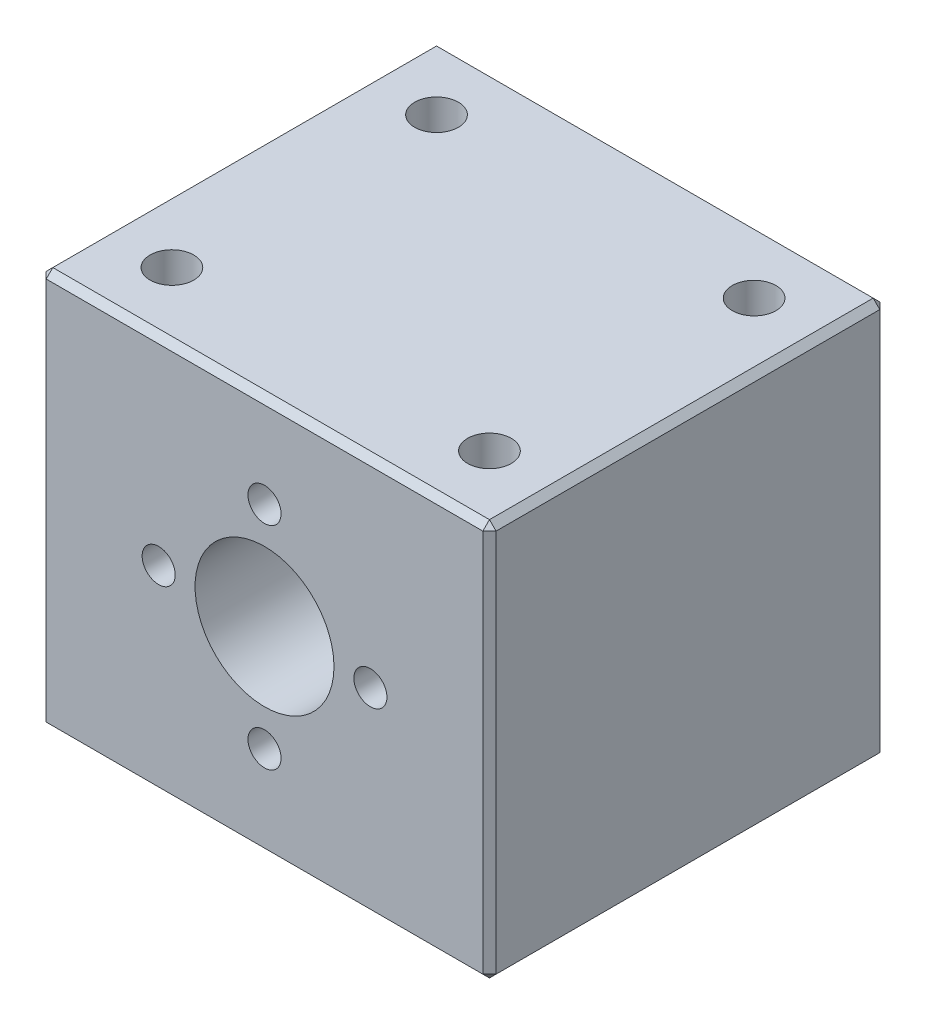
ISO-10303-21;
HEADER;
FILE_DESCRIPTION(('STEP AP214'),'2;1');
FILE_NAME('part.step','',(''),(''),'','','');
FILE_SCHEMA(('AUTOMOTIVE_DESIGN { 1 0 10303 214 1 1 1 1 }'));
ENDSEC;
DATA;
#1=APPLICATION_CONTEXT('core data for automotive mechanical design processes');
#2=APPLICATION_PROTOCOL_DEFINITION('international standard','automotive_design',2000,#1);
#3=PRODUCT_CONTEXT('',#1,'mechanical');
#4=PRODUCT('Part','Part','',(#3));
#5=PRODUCT_RELATED_PRODUCT_CATEGORY('part','',(#4));
#6=PRODUCT_DEFINITION_FORMATION('','',#4);
#7=PRODUCT_DEFINITION_CONTEXT('part definition',#1,'design');
#8=PRODUCT_DEFINITION('design','',#6,#7);
#9=PRODUCT_DEFINITION_SHAPE('','',#8);
#10=(LENGTH_UNIT() NAMED_UNIT(*) SI_UNIT(.MILLI.,.METRE.));
#11=(NAMED_UNIT(*) PLANE_ANGLE_UNIT() SI_UNIT($,.RADIAN.));
#12=(NAMED_UNIT(*) SI_UNIT($,.STERADIAN.) SOLID_ANGLE_UNIT());
#13=UNCERTAINTY_MEASURE_WITH_UNIT(LENGTH_MEASURE(1.E-05),#10,'distance_accuracy_value','');
#14=(GEOMETRIC_REPRESENTATION_CONTEXT(3) GLOBAL_UNCERTAINTY_ASSIGNED_CONTEXT((#13)) GLOBAL_UNIT_ASSIGNED_CONTEXT((#10,
#11,#12)) REPRESENTATION_CONTEXT('',''));
#15=CARTESIAN_POINT('',(0.,0.,0.));
#16=DIRECTION('',(0.,0.,1.));
#17=DIRECTION('',(1.,0.,0.));
#18=AXIS2_PLACEMENT_3D('',#15,#16,#17);
#19=CARTESIAN_POINT('',(17.,15.,15.));
#20=DIRECTION('',(-1.,0.,0.));
#21=DIRECTION('',(0.,-1.,0.));
#22=AXIS2_PLACEMENT_3D('',#19,#20,#21);
#23=PLANE('',#22);
#24=DIRECTION('',(0.,-1.,0.));
#25=VECTOR('',#24,1.);
#26=CARTESIAN_POINT('',(17.,-15.,14.5));
#27=LINE('',#26,#25);
#28=CARTESIAN_POINT('',(17.,14.5,14.5));
#29=VERTEX_POINT('',#28);
#30=CARTESIAN_POINT('',(17.,-14.5,14.5));
#31=VERTEX_POINT('',#30);
#32=EDGE_CURVE('E47',#29,#31,#27,.T.);
#33=ORIENTED_EDGE('',*,*,#32,.T.);
#34=DIRECTION('',(0.,0.,-1.));
#35=VECTOR('',#34,1.);
#36=CARTESIAN_POINT('',(17.,-14.5,15.));
#37=LINE('',#36,#35);
#38=CARTESIAN_POINT('',(17.,-14.5,-14.5));
#39=VERTEX_POINT('',#38);
#40=EDGE_CURVE('E11',#31,#39,#37,.T.);
#41=ORIENTED_EDGE('',*,*,#40,.T.);
#42=DIRECTION('',(0.,1.,0.));
#43=VECTOR('',#42,1.);
#44=CARTESIAN_POINT('',(17.,15.,-14.5));
#45=LINE('',#44,#43);
#46=CARTESIAN_POINT('',(17.,14.5,-14.5));
#47=VERTEX_POINT('',#46);
#48=EDGE_CURVE('E256',#39,#47,#45,.T.);
#49=ORIENTED_EDGE('',*,*,#48,.T.);
#50=DIRECTION('',(0.,0.,1.));
#51=VECTOR('',#50,1.);
#52=CARTESIAN_POINT('',(17.,14.5,15.));
#53=LINE('',#52,#51);
#54=EDGE_CURVE('E58',#47,#29,#53,.T.);
#55=ORIENTED_EDGE('',*,*,#54,.T.);
#56=EDGE_LOOP('',(#33,#41,#49,#55));
#57=FACE_BOUND('',#56,.T.);
#58=ADVANCED_FACE('F37',(#57),#23,.F.);
#59=CARTESIAN_POINT('',(-17.,15.,15.));
#60=DIRECTION('',(0.,-1.,0.));
#61=DIRECTION('',(0.,0.,-1.));
#62=AXIS2_PLACEMENT_3D('',#59,#60,#61);
#63=PLANE('',#62);
#64=DIRECTION('',(-1.,0.,0.));
#65=VECTOR('',#64,1.);
#66=CARTESIAN_POINT('',(-17.,15.,-14.5));
#67=LINE('',#66,#65);
#68=CARTESIAN_POINT('',(16.5,15.,-14.5));
#69=VERTEX_POINT('',#68);
#70=CARTESIAN_POINT('',(-16.5,15.,-14.5));
#71=VERTEX_POINT('',#70);
#72=EDGE_CURVE('E220',#69,#71,#67,.T.);
#73=ORIENTED_EDGE('',*,*,#72,.T.);
#74=DIRECTION('',(0.,0.,1.));
#75=VECTOR('',#74,1.);
#76=CARTESIAN_POINT('',(-16.5,15.,15.));
#77=LINE('',#76,#75);
#78=CARTESIAN_POINT('',(-16.5,15.,14.5));
#79=VERTEX_POINT('',#78);
#80=EDGE_CURVE('E226',#71,#79,#77,.T.);
#81=ORIENTED_EDGE('',*,*,#80,.T.);
#82=DIRECTION('',(1.,0.,0.));
#83=VECTOR('',#82,1.);
#84=CARTESIAN_POINT('',(17.,15.,14.5));
#85=LINE('',#84,#83);
#86=CARTESIAN_POINT('',(16.5,15.,14.5));
#87=VERTEX_POINT('',#86);
#88=EDGE_CURVE('E224',#79,#87,#85,.T.);
#89=ORIENTED_EDGE('',*,*,#88,.T.);
#90=DIRECTION('',(0.,0.,-1.));
#91=VECTOR('',#90,1.);
#92=CARTESIAN_POINT('',(16.5,15.,15.));
#93=LINE('',#92,#91);
#94=EDGE_CURVE('E222',#87,#69,#93,.T.);
#95=ORIENTED_EDGE('',*,*,#94,.T.);
#96=EDGE_LOOP('',(#73,#81,#89,#95));
#97=FACE_BOUND('',#96,.T.);
#98=CARTESIAN_POINT('',(12.,15.,10.));
#99=DIRECTION('',(0.,1.,0.));
#100=DIRECTION('',(0.,0.,1.));
#101=AXIS2_PLACEMENT_3D('',#98,#99,#100);
#102=CIRCLE('',#101,1.65);
#103=CARTESIAN_POINT('',(12.,15.,11.65));
#104=VERTEX_POINT('',#103);
#105=EDGE_CURVE('E159',#104,#104,#102,.T.);
#106=ORIENTED_EDGE('',*,*,#105,.F.);
#107=EDGE_LOOP('',(#106));
#108=FACE_BOUND('',#107,.T.);
#109=CARTESIAN_POINT('',(-12.,15.,-10.));
#110=DIRECTION('',(0.,1.,0.));
#111=DIRECTION('',(0.,0.,1.));
#112=AXIS2_PLACEMENT_3D('',#109,#110,#111);
#113=CIRCLE('',#112,1.65);
#114=CARTESIAN_POINT('',(-12.,15.,-8.35));
#115=VERTEX_POINT('',#114);
#116=EDGE_CURVE('E158',#115,#115,#113,.T.);
#117=ORIENTED_EDGE('',*,*,#116,.F.);
#118=EDGE_LOOP('',(#117));
#119=FACE_BOUND('',#118,.T.);
#120=CARTESIAN_POINT('',(-12.,15.,10.));
#121=DIRECTION('',(0.,1.,0.));
#122=DIRECTION('',(0.,0.,1.));
#123=AXIS2_PLACEMENT_3D('',#120,#121,#122);
#124=CIRCLE('',#123,1.65);
#125=CARTESIAN_POINT('',(-12.,15.,11.65));
#126=VERTEX_POINT('',#125);
#127=EDGE_CURVE('E169',#126,#126,#124,.T.);
#128=ORIENTED_EDGE('',*,*,#127,.F.);
#129=EDGE_LOOP('',(#128));
#130=FACE_BOUND('',#129,.T.);
#131=CARTESIAN_POINT('',(12.,15.,-10.));
#132=DIRECTION('',(0.,1.,0.));
#133=DIRECTION('',(0.,0.,1.));
#134=AXIS2_PLACEMENT_3D('',#131,#132,#133);
#135=CIRCLE('',#134,1.65);
#136=CARTESIAN_POINT('',(12.,15.,-8.35));
#137=VERTEX_POINT('',#136);
#138=EDGE_CURVE('E175',#137,#137,#135,.T.);
#139=ORIENTED_EDGE('',*,*,#138,.F.);
#140=EDGE_LOOP('',(#139));
#141=FACE_BOUND('',#140,.T.);
#142=ADVANCED_FACE('F384',(#97,#108,#119,#130,#141),#63,.F.);
#143=CARTESIAN_POINT('',(-17.,15.,15.));
#144=DIRECTION('',(1.,0.,0.));
#145=DIRECTION('',(0.,1.,0.));
#146=AXIS2_PLACEMENT_3D('',#143,#144,#145);
#147=PLANE('',#146);
#148=DIRECTION('',(0.,1.,0.));
#149=VECTOR('',#148,1.);
#150=CARTESIAN_POINT('',(-17.,15.,14.5));
#151=LINE('',#150,#149);
#152=CARTESIAN_POINT('',(-17.,-14.5,14.5));
#153=VERTEX_POINT('',#152);
#154=CARTESIAN_POINT('',(-17.,14.5,14.5));
#155=VERTEX_POINT('',#154);
#156=EDGE_CURVE('E215',#153,#155,#151,.T.);
#157=ORIENTED_EDGE('',*,*,#156,.T.);
#158=DIRECTION('',(0.,0.,-1.));
#159=VECTOR('',#158,1.);
#160=CARTESIAN_POINT('',(-17.,14.5,15.));
#161=LINE('',#160,#159);
#162=CARTESIAN_POINT('',(-17.,14.5,-14.5));
#163=VERTEX_POINT('',#162);
#164=EDGE_CURVE('E217',#155,#163,#161,.T.);
#165=ORIENTED_EDGE('',*,*,#164,.T.);
#166=DIRECTION('',(0.,-1.,0.));
#167=VECTOR('',#166,1.);
#168=CARTESIAN_POINT('',(-17.,15.,-14.5));
#169=LINE('',#168,#167);
#170=CARTESIAN_POINT('',(-17.,-14.5,-14.5));
#171=VERTEX_POINT('',#170);
#172=EDGE_CURVE('E209',#163,#171,#169,.T.);
#173=ORIENTED_EDGE('',*,*,#172,.T.);
#174=DIRECTION('',(0.,0.,1.));
#175=VECTOR('',#174,1.);
#176=CARTESIAN_POINT('',(-17.,-14.5,15.));
#177=LINE('',#176,#175);
#178=EDGE_CURVE('E213',#171,#153,#177,.T.);
#179=ORIENTED_EDGE('',*,*,#178,.T.);
#180=EDGE_LOOP('',(#157,#165,#173,#179));
#181=FACE_BOUND('',#180,.T.);
#182=ADVANCED_FACE('F418',(#181),#147,.F.);
#183=CARTESIAN_POINT('',(-17.,-15.,15.));
#184=DIRECTION('',(0.,1.,0.));
#185=DIRECTION('',(0.,0.,1.));
#186=AXIS2_PLACEMENT_3D('',#183,#184,#185);
#187=PLANE('',#186);
#188=DIRECTION('',(0.,0.,1.));
#189=VECTOR('',#188,1.);
#190=CARTESIAN_POINT('',(16.5,-15.,15.));
#191=LINE('',#190,#189);
#192=CARTESIAN_POINT('',(16.5,-15.,-14.5));
#193=VERTEX_POINT('',#192);
#194=CARTESIAN_POINT('',(16.5,-15.,14.5));
#195=VERTEX_POINT('',#194);
#196=EDGE_CURVE('E240',#193,#195,#191,.T.);
#197=ORIENTED_EDGE('',*,*,#196,.T.);
#198=DIRECTION('',(-1.,0.,0.));
#199=VECTOR('',#198,1.);
#200=CARTESIAN_POINT('',(-17.,-15.,14.5));
#201=LINE('',#200,#199);
#202=CARTESIAN_POINT('',(-16.5,-15.,14.5));
#203=VERTEX_POINT('',#202);
#204=EDGE_CURVE('E245',#195,#203,#201,.T.);
#205=ORIENTED_EDGE('',*,*,#204,.T.);
#206=DIRECTION('',(0.,0.,-1.));
#207=VECTOR('',#206,1.);
#208=CARTESIAN_POINT('',(-16.5,-15.,15.));
#209=LINE('',#208,#207);
#210=CARTESIAN_POINT('',(-16.5,-15.,-14.5));
#211=VERTEX_POINT('',#210);
#212=EDGE_CURVE('E242',#203,#211,#209,.T.);
#213=ORIENTED_EDGE('',*,*,#212,.T.);
#214=DIRECTION('',(1.,0.,0.));
#215=VECTOR('',#214,1.);
#216=CARTESIAN_POINT('',(-17.,-15.,-14.5));
#217=LINE('',#216,#215);
#218=EDGE_CURVE('E238',#211,#193,#217,.T.);
#219=ORIENTED_EDGE('',*,*,#218,.T.);
#220=EDGE_LOOP('',(#197,#205,#213,#219));
#221=FACE_BOUND('',#220,.T.);
#222=ADVANCED_FACE('F352',(#221),#187,.F.);
#223=CARTESIAN_POINT('',(0.,0.,15.));
#224=DIRECTION('',(0.,0.,1.));
#225=DIRECTION('',(1.,0.,0.));
#226=AXIS2_PLACEMENT_3D('',#223,#224,#225);
#227=PLANE('',#226);
#228=DIRECTION('',(-1.,0.,0.));
#229=VECTOR('',#228,1.);
#230=CARTESIAN_POINT('',(-17.,14.5,15.));
#231=LINE('',#230,#229);
#232=CARTESIAN_POINT('',(16.5,14.5,15.));
#233=VERTEX_POINT('',#232);
#234=CARTESIAN_POINT('',(-16.5,14.5,15.));
#235=VERTEX_POINT('',#234);
#236=EDGE_CURVE('E229',#233,#235,#231,.T.);
#237=ORIENTED_EDGE('',*,*,#236,.T.);
#238=DIRECTION('',(0.,-1.,0.));
#239=VECTOR('',#238,1.);
#240=CARTESIAN_POINT('',(-16.5,-15.,15.));
#241=LINE('',#240,#239);
#242=CARTESIAN_POINT('',(-16.5,-14.5,15.));
#243=VERTEX_POINT('',#242);
#244=EDGE_CURVE('E235',#235,#243,#241,.T.);
#245=ORIENTED_EDGE('',*,*,#244,.T.);
#246=DIRECTION('',(1.,0.,0.));
#247=VECTOR('',#246,1.);
#248=CARTESIAN_POINT('',(17.,-14.5,15.));
#249=LINE('',#248,#247);
#250=CARTESIAN_POINT('',(16.5,-14.5,15.));
#251=VERTEX_POINT('',#250);
#252=EDGE_CURVE('E233',#243,#251,#249,.T.);
#253=ORIENTED_EDGE('',*,*,#252,.T.);
#254=DIRECTION('',(0.,1.,0.));
#255=VECTOR('',#254,1.);
#256=CARTESIAN_POINT('',(16.5,15.,15.));
#257=LINE('',#256,#255);
#258=EDGE_CURVE('E231',#251,#233,#257,.T.);
#259=ORIENTED_EDGE('',*,*,#258,.T.);
#260=EDGE_LOOP('',(#237,#245,#253,#259));
#261=FACE_BOUND('',#260,.T.);
#262=CARTESIAN_POINT('',(8.,0.,15.));
#263=DIRECTION('',(0.,0.,1.));
#264=DIRECTION('',(1.,0.,0.));
#265=AXIS2_PLACEMENT_3D('',#262,#263,#264);
#266=CIRCLE('',#265,1.25);
#267=CARTESIAN_POINT('',(9.25,0.,15.));
#268=VERTEX_POINT('',#267);
#269=EDGE_CURVE('E181',#268,#268,#266,.T.);
#270=ORIENTED_EDGE('',*,*,#269,.F.);
#271=EDGE_LOOP('',(#270));
#272=FACE_BOUND('',#271,.T.);
#273=CARTESIAN_POINT('',(-8.,0.,15.));
#274=DIRECTION('',(0.,0.,1.));
#275=DIRECTION('',(1.,0.,0.));
#276=AXIS2_PLACEMENT_3D('',#273,#274,#275);
#277=CIRCLE('',#276,1.25);
#278=CARTESIAN_POINT('',(-6.75,0.,15.));
#279=VERTEX_POINT('',#278);
#280=EDGE_CURVE('E187',#279,#279,#277,.T.);
#281=ORIENTED_EDGE('',*,*,#280,.F.);
#282=EDGE_LOOP('',(#281));
#283=FACE_BOUND('',#282,.T.);
#284=CARTESIAN_POINT('',(0.,8.,15.));
#285=DIRECTION('',(0.,0.,1.));
#286=DIRECTION('',(1.,0.,0.));
#287=AXIS2_PLACEMENT_3D('',#284,#285,#286);
#288=CIRCLE('',#287,1.25);
#289=CARTESIAN_POINT('',(1.25,8.,15.));
#290=VERTEX_POINT('',#289);
#291=EDGE_CURVE('E193',#290,#290,#288,.T.);
#292=ORIENTED_EDGE('',*,*,#291,.F.);
#293=EDGE_LOOP('',(#292));
#294=FACE_BOUND('',#293,.T.);
#295=CARTESIAN_POINT('',(0.,-8.,15.));
#296=DIRECTION('',(0.,0.,1.));
#297=DIRECTION('',(1.,0.,0.));
#298=AXIS2_PLACEMENT_3D('',#295,#296,#297);
#299=CIRCLE('',#298,1.25);
#300=CARTESIAN_POINT('',(1.25,-8.,15.));
#301=VERTEX_POINT('',#300);
#302=EDGE_CURVE('E199',#301,#301,#299,.T.);
#303=ORIENTED_EDGE('',*,*,#302,.F.);
#304=EDGE_LOOP('',(#303));
#305=FACE_BOUND('',#304,.T.);
#306=CARTESIAN_POINT('',(0.,0.,15.));
#307=DIRECTION('',(0.,0.,1.));
#308=DIRECTION('',(1.,0.,0.));
#309=AXIS2_PLACEMENT_3D('',#306,#307,#308);
#310=CIRCLE('',#309,5.25);
#311=CARTESIAN_POINT('',(5.25,0.,15.));
#312=VERTEX_POINT('',#311);
#313=EDGE_CURVE('E205',#312,#312,#310,.T.);
#314=ORIENTED_EDGE('',*,*,#313,.F.);
#315=EDGE_LOOP('',(#314));
#316=FACE_BOUND('',#315,.T.);
#317=ADVANCED_FACE('F342',(#261,#272,#283,#294,#305,#316),#227,.T.);
#318=CARTESIAN_POINT('',(0.,0.,-15.));
#319=DIRECTION('',(0.,0.,1.));
#320=DIRECTION('',(1.,0.,0.));
#321=AXIS2_PLACEMENT_3D('',#318,#319,#320);
#322=PLANE('',#321);
#323=DIRECTION('',(-1.,0.,0.));
#324=VECTOR('',#323,1.);
#325=CARTESIAN_POINT('',(0.,-14.5,-15.));
#326=LINE('',#325,#324);
#327=CARTESIAN_POINT('',(16.5,-14.5,-15.));
#328=VERTEX_POINT('',#327);
#329=CARTESIAN_POINT('',(-16.5,-14.5,-15.));
#330=VERTEX_POINT('',#329);
#331=EDGE_CURVE('E247',#328,#330,#326,.T.);
#332=ORIENTED_EDGE('',*,*,#331,.T.);
#333=DIRECTION('',(0.,1.,0.));
#334=VECTOR('',#333,1.);
#335=CARTESIAN_POINT('',(-16.5,0.,-15.));
#336=LINE('',#335,#334);
#337=CARTESIAN_POINT('',(-16.5,14.5,-15.));
#338=VERTEX_POINT('',#337);
#339=EDGE_CURVE('E253',#330,#338,#336,.T.);
#340=ORIENTED_EDGE('',*,*,#339,.T.);
#341=DIRECTION('',(1.,0.,0.));
#342=VECTOR('',#341,1.);
#343=CARTESIAN_POINT('',(0.,14.5,-15.));
#344=LINE('',#343,#342);
#345=CARTESIAN_POINT('',(16.5,14.5,-15.));
#346=VERTEX_POINT('',#345);
#347=EDGE_CURVE('E251',#338,#346,#344,.T.);
#348=ORIENTED_EDGE('',*,*,#347,.T.);
#349=DIRECTION('',(0.,-1.,0.));
#350=VECTOR('',#349,1.);
#351=CARTESIAN_POINT('',(16.5,0.,-15.));
#352=LINE('',#351,#350);
#353=EDGE_CURVE('E249',#346,#328,#352,.T.);
#354=ORIENTED_EDGE('',*,*,#353,.T.);
#355=EDGE_LOOP('',(#332,#340,#348,#354));
#356=FACE_BOUND('',#355,.T.);
#357=CARTESIAN_POINT('',(0.,0.,-15.));
#358=DIRECTION('',(0.,0.,1.));
#359=DIRECTION('',(1.,0.,0.));
#360=AXIS2_PLACEMENT_3D('',#357,#358,#359);
#361=CIRCLE('',#360,5.25);
#362=CARTESIAN_POINT('',(5.25,0.,-15.));
#363=VERTEX_POINT('',#362);
#364=EDGE_CURVE('E206',#363,#363,#361,.T.);
#365=ORIENTED_EDGE('',*,*,#364,.T.);
#366=EDGE_LOOP('',(#365));
#367=FACE_BOUND('',#366,.T.);
#368=ADVANCED_FACE('F580',(#356,#367),#322,.F.);
#369=CARTESIAN_POINT('',(0.,0.,-15.));
#370=DIRECTION('',(0.,0.,1.));
#371=DIRECTION('',(1.,0.,0.));
#372=AXIS2_PLACEMENT_3D('',#369,#370,#371);
#373=CYLINDRICAL_SURFACE('',#372,5.25);
#374=ORIENTED_EDGE('',*,*,#364,.F.);
#375=EDGE_LOOP('',(#374));
#376=FACE_BOUND('',#375,.T.);
#377=ORIENTED_EDGE('',*,*,#313,.T.);
#378=EDGE_LOOP('',(#377));
#379=FACE_BOUND('',#378,.T.);
#380=ADVANCED_FACE('F576',(#376,#379),#373,.F.);
#381=CARTESIAN_POINT('',(0.,-8.,5.));
#382=DIRECTION('',(0.,0.,1.));
#383=DIRECTION('',(1.,0.,0.));
#384=AXIS2_PLACEMENT_3D('',#381,#382,#383);
#385=CONICAL_SURFACE('',#384,1.25,1.02974425867665);
#386=CARTESIAN_POINT('',(0.,-8.,4.24892422621555));
#387=VERTEX_POINT('',#386);
#388=VERTEX_LOOP('',#387);
#389=FACE_BOUND('',#388,.T.);
#390=CARTESIAN_POINT('',(0.,-8.,5.));
#391=DIRECTION('',(0.,0.,1.));
#392=DIRECTION('',(1.,0.,0.));
#393=AXIS2_PLACEMENT_3D('',#390,#391,#392);
#394=CIRCLE('',#393,1.25);
#395=CARTESIAN_POINT('',(1.25,-8.,5.));
#396=VERTEX_POINT('',#395);
#397=EDGE_CURVE('E202',#396,#396,#394,.T.);
#398=ORIENTED_EDGE('',*,*,#397,.T.);
#399=EDGE_LOOP('',(#398));
#400=FACE_BOUND('',#399,.T.);
#401=ADVANCED_FACE('F572',(#389,#400),#385,.F.);
#402=CARTESIAN_POINT('',(0.,-8.,15.));
#403=DIRECTION('',(0.,0.,1.));
#404=DIRECTION('',(1.,0.,0.));
#405=AXIS2_PLACEMENT_3D('',#402,#403,#404);
#406=CYLINDRICAL_SURFACE('',#405,1.25);
#407=ORIENTED_EDGE('',*,*,#397,.F.);
#408=EDGE_LOOP('',(#407));
#409=FACE_BOUND('',#408,.T.);
#410=ORIENTED_EDGE('',*,*,#302,.T.);
#411=EDGE_LOOP('',(#410));
#412=FACE_BOUND('',#411,.T.);
#413=ADVANCED_FACE('F568',(#409,#412),#406,.F.);
#414=CARTESIAN_POINT('',(0.,8.,5.));
#415=DIRECTION('',(0.,0.,1.));
#416=DIRECTION('',(1.,0.,0.));
#417=AXIS2_PLACEMENT_3D('',#414,#415,#416);
#418=CONICAL_SURFACE('',#417,1.25,1.02974425867665);
#419=CARTESIAN_POINT('',(0.,8.,4.24892422621555));
#420=VERTEX_POINT('',#419);
#421=VERTEX_LOOP('',#420);
#422=FACE_BOUND('',#421,.T.);
#423=CARTESIAN_POINT('',(0.,8.,5.));
#424=DIRECTION('',(0.,0.,1.));
#425=DIRECTION('',(1.,0.,0.));
#426=AXIS2_PLACEMENT_3D('',#423,#424,#425);
#427=CIRCLE('',#426,1.25);
#428=CARTESIAN_POINT('',(1.25,8.,5.));
#429=VERTEX_POINT('',#428);
#430=EDGE_CURVE('E196',#429,#429,#427,.T.);
#431=ORIENTED_EDGE('',*,*,#430,.T.);
#432=EDGE_LOOP('',(#431));
#433=FACE_BOUND('',#432,.T.);
#434=ADVANCED_FACE('F564',(#422,#433),#418,.F.);
#435=CARTESIAN_POINT('',(0.,8.,15.));
#436=DIRECTION('',(0.,0.,1.));
#437=DIRECTION('',(1.,0.,0.));
#438=AXIS2_PLACEMENT_3D('',#435,#436,#437);
#439=CYLINDRICAL_SURFACE('',#438,1.25);
#440=ORIENTED_EDGE('',*,*,#430,.F.);
#441=EDGE_LOOP('',(#440));
#442=FACE_BOUND('',#441,.T.);
#443=ORIENTED_EDGE('',*,*,#291,.T.);
#444=EDGE_LOOP('',(#443));
#445=FACE_BOUND('',#444,.T.);
#446=ADVANCED_FACE('F560',(#442,#445),#439,.F.);
#447=CARTESIAN_POINT('',(-8.,0.,5.));
#448=DIRECTION('',(0.,0.,1.));
#449=DIRECTION('',(1.,0.,0.));
#450=AXIS2_PLACEMENT_3D('',#447,#448,#449);
#451=CONICAL_SURFACE('',#450,1.25,1.02974425867665);
#452=CARTESIAN_POINT('',(-8.,0.,4.24892422621555));
#453=VERTEX_POINT('',#452);
#454=VERTEX_LOOP('',#453);
#455=FACE_BOUND('',#454,.T.);
#456=CARTESIAN_POINT('',(-8.,0.,5.));
#457=DIRECTION('',(0.,0.,1.));
#458=DIRECTION('',(1.,0.,0.));
#459=AXIS2_PLACEMENT_3D('',#456,#457,#458);
#460=CIRCLE('',#459,1.25);
#461=CARTESIAN_POINT('',(-6.75,0.,5.));
#462=VERTEX_POINT('',#461);
#463=EDGE_CURVE('E190',#462,#462,#460,.T.);
#464=ORIENTED_EDGE('',*,*,#463,.T.);
#465=EDGE_LOOP('',(#464));
#466=FACE_BOUND('',#465,.T.);
#467=ADVANCED_FACE('F556',(#455,#466),#451,.F.);
#468=CARTESIAN_POINT('',(-8.,0.,15.));
#469=DIRECTION('',(0.,0.,1.));
#470=DIRECTION('',(1.,0.,0.));
#471=AXIS2_PLACEMENT_3D('',#468,#469,#470);
#472=CYLINDRICAL_SURFACE('',#471,1.25);
#473=ORIENTED_EDGE('',*,*,#463,.F.);
#474=EDGE_LOOP('',(#473));
#475=FACE_BOUND('',#474,.T.);
#476=ORIENTED_EDGE('',*,*,#280,.T.);
#477=EDGE_LOOP('',(#476));
#478=FACE_BOUND('',#477,.T.);
#479=ADVANCED_FACE('F552',(#475,#478),#472,.F.);
#480=CARTESIAN_POINT('',(8.,0.,5.));
#481=DIRECTION('',(0.,0.,1.));
#482=DIRECTION('',(1.,0.,0.));
#483=AXIS2_PLACEMENT_3D('',#480,#481,#482);
#484=CONICAL_SURFACE('',#483,1.25,1.02974425867665);
#485=CARTESIAN_POINT('',(8.,0.,4.24892422621555));
#486=VERTEX_POINT('',#485);
#487=VERTEX_LOOP('',#486);
#488=FACE_BOUND('',#487,.T.);
#489=CARTESIAN_POINT('',(8.,0.,5.));
#490=DIRECTION('',(0.,0.,1.));
#491=DIRECTION('',(1.,0.,0.));
#492=AXIS2_PLACEMENT_3D('',#489,#490,#491);
#493=CIRCLE('',#492,1.25);
#494=CARTESIAN_POINT('',(9.25,0.,5.));
#495=VERTEX_POINT('',#494);
#496=EDGE_CURVE('E184',#495,#495,#493,.T.);
#497=ORIENTED_EDGE('',*,*,#496,.T.);
#498=EDGE_LOOP('',(#497));
#499=FACE_BOUND('',#498,.T.);
#500=ADVANCED_FACE('F548',(#488,#499),#484,.F.);
#501=CARTESIAN_POINT('',(8.,0.,15.));
#502=DIRECTION('',(0.,0.,1.));
#503=DIRECTION('',(1.,0.,0.));
#504=AXIS2_PLACEMENT_3D('',#501,#502,#503);
#505=CYLINDRICAL_SURFACE('',#504,1.25);
#506=ORIENTED_EDGE('',*,*,#496,.F.);
#507=EDGE_LOOP('',(#506));
#508=FACE_BOUND('',#507,.T.);
#509=ORIENTED_EDGE('',*,*,#269,.T.);
#510=EDGE_LOOP('',(#509));
#511=FACE_BOUND('',#510,.T.);
#512=ADVANCED_FACE('F544',(#508,#511),#505,.F.);
#513=CARTESIAN_POINT('',(12.,-5.,-10.));
#514=DIRECTION('',(0.,1.,0.));
#515=DIRECTION('',(0.,0.,1.));
#516=AXIS2_PLACEMENT_3D('',#513,#514,#515);
#517=CONICAL_SURFACE('',#516,1.65,1.02974425867665);
#518=CARTESIAN_POINT('',(12.,-5.99142002139548,-10.));
#519=VERTEX_POINT('',#518);
#520=VERTEX_LOOP('',#519);
#521=FACE_BOUND('',#520,.T.);
#522=CARTESIAN_POINT('',(12.,-5.,-10.));
#523=DIRECTION('',(0.,1.,0.));
#524=DIRECTION('',(0.,0.,1.));
#525=AXIS2_PLACEMENT_3D('',#522,#523,#524);
#526=CIRCLE('',#525,1.65);
#527=CARTESIAN_POINT('',(12.,-5.,-8.35));
#528=VERTEX_POINT('',#527);
#529=EDGE_CURVE('E178',#528,#528,#526,.T.);
#530=ORIENTED_EDGE('',*,*,#529,.T.);
#531=EDGE_LOOP('',(#530));
#532=FACE_BOUND('',#531,.T.);
#533=ADVANCED_FACE('F540',(#521,#532),#517,.F.);
#534=CARTESIAN_POINT('',(12.,15.,-10.));
#535=DIRECTION('',(0.,1.,0.));
#536=DIRECTION('',(0.,0.,1.));
#537=AXIS2_PLACEMENT_3D('',#534,#535,#536);
#538=CYLINDRICAL_SURFACE('',#537,1.65);
#539=ORIENTED_EDGE('',*,*,#529,.F.);
#540=EDGE_LOOP('',(#539));
#541=FACE_BOUND('',#540,.T.);
#542=ORIENTED_EDGE('',*,*,#138,.T.);
#543=EDGE_LOOP('',(#542));
#544=FACE_BOUND('',#543,.T.);
#545=ADVANCED_FACE('F536',(#541,#544),#538,.F.);
#546=CARTESIAN_POINT('',(-12.,-5.,10.));
#547=DIRECTION('',(0.,1.,0.));
#548=DIRECTION('',(0.,0.,1.));
#549=AXIS2_PLACEMENT_3D('',#546,#547,#548);
#550=CONICAL_SURFACE('',#549,1.65,1.02974425867665);
#551=CARTESIAN_POINT('',(-12.,-5.99142002139548,10.));
#552=VERTEX_POINT('',#551);
#553=VERTEX_LOOP('',#552);
#554=FACE_BOUND('',#553,.T.);
#555=CARTESIAN_POINT('',(-12.,-5.,10.));
#556=DIRECTION('',(0.,1.,0.));
#557=DIRECTION('',(0.,0.,1.));
#558=AXIS2_PLACEMENT_3D('',#555,#556,#557);
#559=CIRCLE('',#558,1.65);
#560=CARTESIAN_POINT('',(-12.,-5.,11.65));
#561=VERTEX_POINT('',#560);
#562=EDGE_CURVE('E172',#561,#561,#559,.T.);
#563=ORIENTED_EDGE('',*,*,#562,.T.);
#564=EDGE_LOOP('',(#563));
#565=FACE_BOUND('',#564,.T.);
#566=ADVANCED_FACE('F532',(#554,#565),#550,.F.);
#567=CARTESIAN_POINT('',(-12.,15.,10.));
#568=DIRECTION('',(0.,1.,0.));
#569=DIRECTION('',(0.,0.,1.));
#570=AXIS2_PLACEMENT_3D('',#567,#568,#569);
#571=CYLINDRICAL_SURFACE('',#570,1.65);
#572=ORIENTED_EDGE('',*,*,#562,.F.);
#573=EDGE_LOOP('',(#572));
#574=FACE_BOUND('',#573,.T.);
#575=ORIENTED_EDGE('',*,*,#127,.T.);
#576=EDGE_LOOP('',(#575));
#577=FACE_BOUND('',#576,.T.);
#578=ADVANCED_FACE('F529',(#574,#577),#571,.F.);
#579=CARTESIAN_POINT('',(-12.,-5.,-10.));
#580=DIRECTION('',(0.,1.,0.));
#581=DIRECTION('',(0.,0.,1.));
#582=AXIS2_PLACEMENT_3D('',#579,#580,#581);
#583=CONICAL_SURFACE('',#582,1.65,1.02974425867665);
#584=CARTESIAN_POINT('',(-12.,-5.99142002139548,-10.));
#585=VERTEX_POINT('',#584);
#586=VERTEX_LOOP('',#585);
#587=FACE_BOUND('',#586,.T.);
#588=CARTESIAN_POINT('',(-12.,-5.,-10.));
#589=DIRECTION('',(0.,1.,0.));
#590=DIRECTION('',(0.,0.,1.));
#591=AXIS2_PLACEMENT_3D('',#588,#589,#590);
#592=CIRCLE('',#591,1.65);
#593=CARTESIAN_POINT('',(-12.,-5.,-8.35));
#594=VERTEX_POINT('',#593);
#595=EDGE_CURVE('E162',#594,#594,#592,.T.);
#596=ORIENTED_EDGE('',*,*,#595,.T.);
#597=EDGE_LOOP('',(#596));
#598=FACE_BOUND('',#597,.T.);
#599=ADVANCED_FACE('F525',(#587,#598),#583,.F.);
#600=CARTESIAN_POINT('',(-12.,15.,-10.));
#601=DIRECTION('',(0.,1.,0.));
#602=DIRECTION('',(0.,0.,1.));
#603=AXIS2_PLACEMENT_3D('',#600,#601,#602);
#604=CYLINDRICAL_SURFACE('',#603,1.65);
#605=ORIENTED_EDGE('',*,*,#595,.F.);
#606=EDGE_LOOP('',(#605));
#607=FACE_BOUND('',#606,.T.);
#608=ORIENTED_EDGE('',*,*,#116,.T.);
#609=EDGE_LOOP('',(#608));
#610=FACE_BOUND('',#609,.T.);
#611=ADVANCED_FACE('F152',(#607,#610),#604,.F.);
#612=CARTESIAN_POINT('',(12.,-5.,10.));
#613=DIRECTION('',(0.,1.,0.));
#614=DIRECTION('',(0.,0.,1.));
#615=AXIS2_PLACEMENT_3D('',#612,#613,#614);
#616=CONICAL_SURFACE('',#615,1.65,1.02974425867665);
#617=CARTESIAN_POINT('',(12.,-5.99142002139548,10.));
#618=VERTEX_POINT('',#617);
#619=VERTEX_LOOP('',#618);
#620=FACE_BOUND('',#619,.T.);
#621=CARTESIAN_POINT('',(12.,-5.,10.));
#622=DIRECTION('',(0.,1.,0.));
#623=DIRECTION('',(0.,0.,1.));
#624=AXIS2_PLACEMENT_3D('',#621,#622,#623);
#625=CIRCLE('',#624,1.65);
#626=CARTESIAN_POINT('',(12.,-5.,11.65));
#627=VERTEX_POINT('',#626);
#628=EDGE_CURVE('E156',#627,#627,#625,.T.);
#629=ORIENTED_EDGE('',*,*,#628,.T.);
#630=EDGE_LOOP('',(#629));
#631=FACE_BOUND('',#630,.T.);
#632=ADVANCED_FACE('F148',(#620,#631),#616,.F.);
#633=CARTESIAN_POINT('',(12.,15.,10.));
#634=DIRECTION('',(0.,1.,0.));
#635=DIRECTION('',(0.,0.,1.));
#636=AXIS2_PLACEMENT_3D('',#633,#634,#635);
#637=CYLINDRICAL_SURFACE('',#636,1.65);
#638=ORIENTED_EDGE('',*,*,#628,.F.);
#639=EDGE_LOOP('',(#638));
#640=FACE_BOUND('',#639,.T.);
#641=ORIENTED_EDGE('',*,*,#105,.T.);
#642=EDGE_LOOP('',(#641));
#643=FACE_BOUND('',#642,.T.);
#644=ADVANCED_FACE('F151',(#640,#643),#637,.F.);
#645=CARTESIAN_POINT('',(17.,-14.5,15.));
#646=DIRECTION('',(-0.707106781186546,0.707106781186549,0.));
#647=DIRECTION('',(0.,0.,-1.));
#648=AXIS2_PLACEMENT_3D('',#645,#646,#647);
#649=PLANE('',#648);
#650=DIRECTION('',(-0.707106781186549,-0.707106781186546,0.));
#651=VECTOR('',#650,1.);
#652=CARTESIAN_POINT('',(16.5,-15.,14.5));
#653=LINE('',#652,#651);
#654=EDGE_CURVE('E42',#195,#31,#653,.F.);
#655=ORIENTED_EDGE('',*,*,#654,.F.);
#656=ORIENTED_EDGE('',*,*,#196,.F.);
#657=DIRECTION('',(0.707106781186549,0.707106781186546,0.));
#658=VECTOR('',#657,1.);
#659=CARTESIAN_POINT('',(17.,-14.5,-14.5));
#660=LINE('',#659,#658);
#661=EDGE_CURVE('E320',#39,#193,#660,.F.);
#662=ORIENTED_EDGE('',*,*,#661,.F.);
#663=ORIENTED_EDGE('',*,*,#40,.F.);
#664=EDGE_LOOP('',(#655,#656,#662,#663));
#665=FACE_BOUND('',#664,.T.);
#666=ADVANCED_FACE('F40',(#665),#649,.F.);
#667=CARTESIAN_POINT('',(16.5,-15.,14.5));
#668=DIRECTION('',(0.577350269189624,-0.577350269189627,0.577350269189627));
#669=DIRECTION('',(0.,-0.707106781186547,-0.707106781186547));
#670=AXIS2_PLACEMENT_3D('',#667,#668,#669);
#671=PLANE('',#670);
#672=DIRECTION('',(0.,-0.707106781186547,-0.707106781186547));
#673=VECTOR('',#672,1.);
#674=CARTESIAN_POINT('',(16.5,-15.,14.5));
#675=LINE('',#674,#673);
#676=EDGE_CURVE('E315',#195,#251,#675,.F.);
#677=ORIENTED_EDGE('',*,*,#676,.F.);
#678=ORIENTED_EDGE('',*,*,#654,.T.);
#679=DIRECTION('',(-0.707106781186549,0.,0.707106781186546));
#680=VECTOR('',#679,1.);
#681=CARTESIAN_POINT('',(16.75,-14.5,14.75));
#682=LINE('',#681,#680);
#683=EDGE_CURVE('E318',#251,#31,#682,.F.);
#684=ORIENTED_EDGE('',*,*,#683,.F.);
#685=EDGE_LOOP('',(#677,#678,#684));
#686=FACE_BOUND('',#685,.T.);
#687=ADVANCED_FACE('F331',(#686),#671,.T.);
#688=CARTESIAN_POINT('',(17.,-14.5,-14.5));
#689=DIRECTION('',(0.577350269189623,-0.577350269189625,-0.577350269189629));
#690=DIRECTION('',(0.,0.70710678118655,-0.707106781186545));
#691=AXIS2_PLACEMENT_3D('',#688,#689,#690);
#692=PLANE('',#691);
#693=DIRECTION('',(-0.707106781186549,0.,-0.707106781186546));
#694=VECTOR('',#693,1.);
#695=CARTESIAN_POINT('',(17.,-14.5,-14.5));
#696=LINE('',#695,#694);
#697=EDGE_CURVE('E309',#39,#328,#696,.T.);
#698=ORIENTED_EDGE('',*,*,#697,.F.);
#699=ORIENTED_EDGE('',*,*,#661,.T.);
#700=DIRECTION('',(0.,-0.707106781186548,0.707106781186548));
#701=VECTOR('',#700,1.);
#702=CARTESIAN_POINT('',(16.5,-14.75,-14.75));
#703=LINE('',#702,#701);
#704=EDGE_CURVE('E312',#328,#193,#703,.T.);
#705=ORIENTED_EDGE('',*,*,#704,.F.);
#706=EDGE_LOOP('',(#698,#699,#705));
#707=FACE_BOUND('',#706,.T.);
#708=ADVANCED_FACE('F504',(#707),#692,.T.);
#709=CARTESIAN_POINT('',(16.5,0.,15.));
#710=DIRECTION('',(0.707106781186546,0.,0.707106781186549));
#711=DIRECTION('',(0.,-1.,0.));
#712=AXIS2_PLACEMENT_3D('',#709,#710,#711);
#713=PLANE('',#712);
#714=ORIENTED_EDGE('',*,*,#683,.T.);
#715=ORIENTED_EDGE('',*,*,#32,.F.);
#716=DIRECTION('',(0.707106781186549,0.,-0.707106781186546));
#717=VECTOR('',#716,1.);
#718=CARTESIAN_POINT('',(16.5,14.5,15.));
#719=LINE('',#718,#717);
#720=EDGE_CURVE('E303',#233,#29,#719,.T.);
#721=ORIENTED_EDGE('',*,*,#720,.F.);
#722=ORIENTED_EDGE('',*,*,#258,.F.);
#723=EDGE_LOOP('',(#714,#715,#721,#722));
#724=FACE_BOUND('',#723,.T.);
#725=ADVANCED_FACE('F337',(#724),#713,.T.);
#726=CARTESIAN_POINT('',(0.,-14.5,15.));
#727=DIRECTION('',(0.,-0.707106781186547,0.707106781186547));
#728=DIRECTION('',(-1.,0.,0.));
#729=AXIS2_PLACEMENT_3D('',#726,#727,#728);
#730=PLANE('',#729);
#731=ORIENTED_EDGE('',*,*,#676,.T.);
#732=ORIENTED_EDGE('',*,*,#252,.F.);
#733=DIRECTION('',(0.,0.707106781186547,0.707106781186547));
#734=VECTOR('',#733,1.);
#735=CARTESIAN_POINT('',(-16.5,-14.5,15.));
#736=LINE('',#735,#734);
#737=EDGE_CURVE('E300',#203,#243,#736,.T.);
#738=ORIENTED_EDGE('',*,*,#737,.F.);
#739=ORIENTED_EDGE('',*,*,#204,.F.);
#740=EDGE_LOOP('',(#731,#732,#738,#739));
#741=FACE_BOUND('',#740,.T.);
#742=ADVANCED_FACE('F349',(#741),#730,.T.);
#743=CARTESIAN_POINT('',(-16.5,-15.,15.));
#744=DIRECTION('',(0.707106781186546,0.707106781186549,0.));
#745=DIRECTION('',(0.,0.,-1.));
#746=AXIS2_PLACEMENT_3D('',#743,#744,#745);
#747=PLANE('',#746);
#748=DIRECTION('',(0.707106781186549,-0.707106781186546,0.));
#749=VECTOR('',#748,1.);
#750=CARTESIAN_POINT('',(-16.5,-15.,-14.5));
#751=LINE('',#750,#749);
#752=EDGE_CURVE('E294',#211,#171,#751,.F.);
#753=ORIENTED_EDGE('',*,*,#752,.F.);
#754=ORIENTED_EDGE('',*,*,#212,.F.);
#755=DIRECTION('',(-0.707106781186549,0.707106781186546,0.));
#756=VECTOR('',#755,1.);
#757=CARTESIAN_POINT('',(-16.75,-14.75,14.5));
#758=LINE('',#757,#756);
#759=EDGE_CURVE('E297',#153,#203,#758,.F.);
#760=ORIENTED_EDGE('',*,*,#759,.F.);
#761=ORIENTED_EDGE('',*,*,#178,.F.);
#762=EDGE_LOOP('',(#753,#754,#760,#761));
#763=FACE_BOUND('',#762,.T.);
#764=ADVANCED_FACE('F356',(#763),#747,.F.);
#765=CARTESIAN_POINT('',(-17.,-15.,-14.5));
#766=DIRECTION('',(0.,0.707106781186547,0.707106781186547));
#767=DIRECTION('',(1.,0.,0.));
#768=AXIS2_PLACEMENT_3D('',#765,#766,#767);
#769=PLANE('',#768);
#770=ORIENTED_EDGE('',*,*,#704,.T.);
#771=ORIENTED_EDGE('',*,*,#218,.F.);
#772=DIRECTION('',(0.,0.707106781186547,-0.707106781186547));
#773=VECTOR('',#772,1.);
#774=CARTESIAN_POINT('',(-16.5,-15.,-14.5));
#775=LINE('',#774,#773);
#776=EDGE_CURVE('E292',#330,#211,#775,.F.);
#777=ORIENTED_EDGE('',*,*,#776,.F.);
#778=ORIENTED_EDGE('',*,*,#331,.F.);
#779=EDGE_LOOP('',(#770,#771,#777,#778));
#780=FACE_BOUND('',#779,.T.);
#781=ADVANCED_FACE('F364',(#780),#769,.F.);
#782=CARTESIAN_POINT('',(17.,15.,-14.5));
#783=DIRECTION('',(-0.707106781186546,0.,0.707106781186549));
#784=DIRECTION('',(0.,1.,0.));
#785=AXIS2_PLACEMENT_3D('',#782,#783,#784);
#786=PLANE('',#785);
#787=ORIENTED_EDGE('',*,*,#697,.T.);
#788=ORIENTED_EDGE('',*,*,#353,.F.);
#789=DIRECTION('',(0.707106781186549,0.,0.707106781186546));
#790=VECTOR('',#789,1.);
#791=CARTESIAN_POINT('',(16.75,14.5,-14.75));
#792=LINE('',#791,#790);
#793=EDGE_CURVE('E289',#47,#346,#792,.F.);
#794=ORIENTED_EDGE('',*,*,#793,.F.);
#795=ORIENTED_EDGE('',*,*,#48,.F.);
#796=EDGE_LOOP('',(#787,#788,#794,#795));
#797=FACE_BOUND('',#796,.T.);
#798=ADVANCED_FACE('F374',(#797),#786,.F.);
#799=CARTESIAN_POINT('',(16.5,15.,15.));
#800=DIRECTION('',(-0.707106781186547,-0.707106781186547,0.));
#801=DIRECTION('',(0.,0.,-1.));
#802=AXIS2_PLACEMENT_3D('',#799,#800,#801);
#803=PLANE('',#802);
#804=DIRECTION('',(0.707106781186547,-0.707106781186547,0.));
#805=VECTOR('',#804,1.);
#806=CARTESIAN_POINT('',(16.75,14.75,14.5));
#807=LINE('',#806,#805);
#808=EDGE_CURVE('E306',#29,#87,#807,.F.);
#809=ORIENTED_EDGE('',*,*,#808,.F.);
#810=ORIENTED_EDGE('',*,*,#54,.F.);
#811=DIRECTION('',(-0.707106781186548,0.707106781186548,0.));
#812=VECTOR('',#811,1.);
#813=CARTESIAN_POINT('',(16.5,15.,-14.5));
#814=LINE('',#813,#812);
#815=EDGE_CURVE('E286',#69,#47,#814,.F.);
#816=ORIENTED_EDGE('',*,*,#815,.F.);
#817=ORIENTED_EDGE('',*,*,#94,.F.);
#818=EDGE_LOOP('',(#809,#810,#816,#817));
#819=FACE_BOUND('',#818,.T.);
#820=ADVANCED_FACE('F370',(#819),#803,.F.);
#821=CARTESIAN_POINT('',(16.5,14.5,15.));
#822=DIRECTION('',(0.577350269189626,0.577350269189626,0.577350269189626));
#823=DIRECTION('',(0.707106781186547,0.,-0.707106781186547));
#824=AXIS2_PLACEMENT_3D('',#821,#822,#823);
#825=PLANE('',#824);
#826=ORIENTED_EDGE('',*,*,#720,.T.);
#827=ORIENTED_EDGE('',*,*,#808,.T.);
#828=DIRECTION('',(0.,-0.707106781186547,0.707106781186547));
#829=VECTOR('',#828,1.);
#830=CARTESIAN_POINT('',(16.5,14.5,15.));
#831=LINE('',#830,#829);
#832=EDGE_CURVE('E283',#233,#87,#831,.F.);
#833=ORIENTED_EDGE('',*,*,#832,.F.);
#834=EDGE_LOOP('',(#826,#827,#833));
#835=FACE_BOUND('',#834,.T.);
#836=ADVANCED_FACE('F388',(#835),#825,.T.);
#837=CARTESIAN_POINT('',(-16.5,-14.5,15.));
#838=DIRECTION('',(-0.577350269189626,-0.577350269189628,0.577350269189624));
#839=DIRECTION('',(0.707106781186549,-0.707106781186546,0.));
#840=AXIS2_PLACEMENT_3D('',#837,#838,#839);
#841=PLANE('',#840);
#842=ORIENTED_EDGE('',*,*,#759,.T.);
#843=ORIENTED_EDGE('',*,*,#737,.T.);
#844=DIRECTION('',(-0.707106781186546,0.,-0.707106781186549));
#845=VECTOR('',#844,1.);
#846=CARTESIAN_POINT('',(-16.5,-14.5,15.));
#847=LINE('',#846,#845);
#848=EDGE_CURVE('E281',#153,#243,#847,.F.);
#849=ORIENTED_EDGE('',*,*,#848,.F.);
#850=EDGE_LOOP('',(#842,#843,#849));
#851=FACE_BOUND('',#850,.T.);
#852=ADVANCED_FACE('F401',(#851),#841,.T.);
#853=CARTESIAN_POINT('',(-16.5,-15.,-14.5));
#854=DIRECTION('',(-0.577350269189626,-0.577350269189628,-0.577350269189624));
#855=DIRECTION('',(0.707106781186549,-0.707106781186546,0.));
#856=AXIS2_PLACEMENT_3D('',#853,#854,#855);
#857=PLANE('',#856);
#858=ORIENTED_EDGE('',*,*,#776,.T.);
#859=ORIENTED_EDGE('',*,*,#752,.T.);
#860=DIRECTION('',(-0.707106781186546,0.,0.707106781186549));
#861=VECTOR('',#860,1.);
#862=CARTESIAN_POINT('',(-16.75,-14.5,-14.75));
#863=LINE('',#862,#861);
#864=EDGE_CURVE('E278',#330,#171,#863,.T.);
#865=ORIENTED_EDGE('',*,*,#864,.F.);
#866=EDGE_LOOP('',(#858,#859,#865));
#867=FACE_BOUND('',#866,.T.);
#868=ADVANCED_FACE('F403',(#867),#857,.T.);
#869=CARTESIAN_POINT('',(16.5,15.,-14.5));
#870=DIRECTION('',(0.577350269189624,0.577350269189624,-0.577350269189629));
#871=DIRECTION('',(-0.70710678118655,0.,-0.707106781186545));
#872=AXIS2_PLACEMENT_3D('',#869,#870,#871);
#873=PLANE('',#872);
#874=ORIENTED_EDGE('',*,*,#815,.T.);
#875=ORIENTED_EDGE('',*,*,#793,.T.);
#876=DIRECTION('',(0.,-0.707106781186547,-0.707106781186547));
#877=VECTOR('',#876,1.);
#878=CARTESIAN_POINT('',(16.5,15.,-14.5));
#879=LINE('',#878,#877);
#880=EDGE_CURVE('E275',#69,#346,#879,.T.);
#881=ORIENTED_EDGE('',*,*,#880,.F.);
#882=EDGE_LOOP('',(#874,#875,#881));
#883=FACE_BOUND('',#882,.T.);
#884=ADVANCED_FACE('F376',(#883),#873,.T.);
#885=CARTESIAN_POINT('',(0.,14.5,15.));
#886=DIRECTION('',(0.,0.707106781186547,0.707106781186547));
#887=DIRECTION('',(1.,0.,0.));
#888=AXIS2_PLACEMENT_3D('',#885,#886,#887);
#889=PLANE('',#888);
#890=ORIENTED_EDGE('',*,*,#832,.T.);
#891=ORIENTED_EDGE('',*,*,#88,.F.);
#892=DIRECTION('',(0.,0.707106781186548,-0.707106781186548));
#893=VECTOR('',#892,1.);
#894=CARTESIAN_POINT('',(-16.5,15.,14.5));
#895=LINE('',#894,#893);
#896=EDGE_CURVE('E272',#235,#79,#895,.T.);
#897=ORIENTED_EDGE('',*,*,#896,.F.);
#898=ORIENTED_EDGE('',*,*,#236,.F.);
#899=EDGE_LOOP('',(#890,#891,#897,#898));
#900=FACE_BOUND('',#899,.T.);
#901=ADVANCED_FACE('F390',(#900),#889,.T.);
#902=CARTESIAN_POINT('',(-16.5,0.,15.));
#903=DIRECTION('',(-0.707106781186549,0.,0.707106781186546));
#904=DIRECTION('',(0.,1.,0.));
#905=AXIS2_PLACEMENT_3D('',#902,#903,#904);
#906=PLANE('',#905);
#907=ORIENTED_EDGE('',*,*,#848,.T.);
#908=ORIENTED_EDGE('',*,*,#244,.F.);
#909=DIRECTION('',(0.707106781186546,0.,0.707106781186549));
#910=VECTOR('',#909,1.);
#911=CARTESIAN_POINT('',(-16.75,14.5,14.75));
#912=LINE('',#911,#910);
#913=EDGE_CURVE('E269',#155,#235,#912,.T.);
#914=ORIENTED_EDGE('',*,*,#913,.F.);
#915=ORIENTED_EDGE('',*,*,#156,.F.);
#916=EDGE_LOOP('',(#907,#908,#914,#915));
#917=FACE_BOUND('',#916,.T.);
#918=ADVANCED_FACE('F399',(#917),#906,.T.);
#919=CARTESIAN_POINT('',(-17.,15.,-14.5));
#920=DIRECTION('',(0.707106781186549,0.,0.707106781186546));
#921=DIRECTION('',(0.,-1.,0.));
#922=AXIS2_PLACEMENT_3D('',#919,#920,#921);
#923=PLANE('',#922);
#924=ORIENTED_EDGE('',*,*,#864,.T.);
#925=ORIENTED_EDGE('',*,*,#172,.F.);
#926=DIRECTION('',(0.707106781186546,0.,-0.707106781186549));
#927=VECTOR('',#926,1.);
#928=CARTESIAN_POINT('',(-17.,14.5,-14.5));
#929=LINE('',#928,#927);
#930=EDGE_CURVE('E266',#338,#163,#929,.F.);
#931=ORIENTED_EDGE('',*,*,#930,.F.);
#932=ORIENTED_EDGE('',*,*,#339,.F.);
#933=EDGE_LOOP('',(#924,#925,#931,#932));
#934=FACE_BOUND('',#933,.T.);
#935=ADVANCED_FACE('F447',(#934),#923,.F.);
#936=CARTESIAN_POINT('',(-17.,15.,-14.5));
#937=DIRECTION('',(0.,-0.707106781186547,0.707106781186547));
#938=DIRECTION('',(-1.,0.,0.));
#939=AXIS2_PLACEMENT_3D('',#936,#937,#938);
#940=PLANE('',#939);
#941=ORIENTED_EDGE('',*,*,#880,.T.);
#942=ORIENTED_EDGE('',*,*,#347,.F.);
#943=DIRECTION('',(0.,0.707106781186548,0.707106781186548));
#944=VECTOR('',#943,1.);
#945=CARTESIAN_POINT('',(-16.5,14.75,-14.75));
#946=LINE('',#945,#944);
#947=EDGE_CURVE('E264',#71,#338,#946,.F.);
#948=ORIENTED_EDGE('',*,*,#947,.F.);
#949=ORIENTED_EDGE('',*,*,#72,.F.);
#950=EDGE_LOOP('',(#941,#942,#948,#949));
#951=FACE_BOUND('',#950,.T.);
#952=ADVANCED_FACE('F381',(#951),#940,.F.);
#953=CARTESIAN_POINT('',(-16.5,15.,14.5));
#954=DIRECTION('',(-0.577350269189627,0.577350269189627,0.577350269189623));
#955=DIRECTION('',(-0.707106781186547,-0.707106781186547,0.));
#956=AXIS2_PLACEMENT_3D('',#953,#954,#955);
#957=PLANE('',#956);
#958=ORIENTED_EDGE('',*,*,#913,.T.);
#959=ORIENTED_EDGE('',*,*,#896,.T.);
#960=DIRECTION('',(0.707106781186548,0.707106781186548,0.));
#961=VECTOR('',#960,1.);
#962=CARTESIAN_POINT('',(-16.5,15.,14.5));
#963=LINE('',#962,#961);
#964=EDGE_CURVE('E262',#155,#79,#963,.T.);
#965=ORIENTED_EDGE('',*,*,#964,.F.);
#966=EDGE_LOOP('',(#958,#959,#965));
#967=FACE_BOUND('',#966,.T.);
#968=ADVANCED_FACE('F395',(#967),#957,.T.);
#969=CARTESIAN_POINT('',(-17.,14.5,-14.5));
#970=DIRECTION('',(-0.577350269189627,0.577350269189627,-0.577350269189623));
#971=DIRECTION('',(-0.707106781186547,-0.707106781186547,0.));
#972=AXIS2_PLACEMENT_3D('',#969,#970,#971);
#973=PLANE('',#972);
#974=ORIENTED_EDGE('',*,*,#947,.T.);
#975=ORIENTED_EDGE('',*,*,#930,.T.);
#976=DIRECTION('',(-0.707106781186548,-0.707106781186548,0.));
#977=VECTOR('',#976,1.);
#978=CARTESIAN_POINT('',(-17.,14.5,-14.5));
#979=LINE('',#978,#977);
#980=EDGE_CURVE('E260',#71,#163,#979,.T.);
#981=ORIENTED_EDGE('',*,*,#980,.F.);
#982=EDGE_LOOP('',(#974,#975,#981));
#983=FACE_BOUND('',#982,.T.);
#984=ADVANCED_FACE('F429',(#983),#973,.T.);
#985=CARTESIAN_POINT('',(-17.,14.5,15.));
#986=DIRECTION('',(0.707106781186547,-0.707106781186547,0.));
#987=DIRECTION('',(0.,0.,-1.));
#988=AXIS2_PLACEMENT_3D('',#985,#986,#987);
#989=PLANE('',#988);
#990=ORIENTED_EDGE('',*,*,#964,.T.);
#991=ORIENTED_EDGE('',*,*,#80,.F.);
#992=ORIENTED_EDGE('',*,*,#980,.T.);
#993=ORIENTED_EDGE('',*,*,#164,.F.);
#994=EDGE_LOOP('',(#990,#991,#992,#993));
#995=FACE_BOUND('',#994,.T.);
#996=ADVANCED_FACE('F423',(#995),#989,.F.);
#997=CLOSED_SHELL('',(#58,#142,#182,#222,#317,#368,#380,#401,#413,#434,#446,#467,#479,#500,#512,
#533,#545,#566,#578,#599,#611,#632,#644,#666,#687,#708,#725,#742,#764,#781,#798,#820,#836,#852,
#868,#884,#901,#918,#935,#952,#968,#984,#996));
#998=MANIFOLD_SOLID_BREP('B2',#997);
#999=ADVANCED_BREP_SHAPE_REPRESENTATION('',(#18,#998),#14);
#1000=SHAPE_DEFINITION_REPRESENTATION(#9,#999);
ENDSEC;
END-ISO-10303-21;
